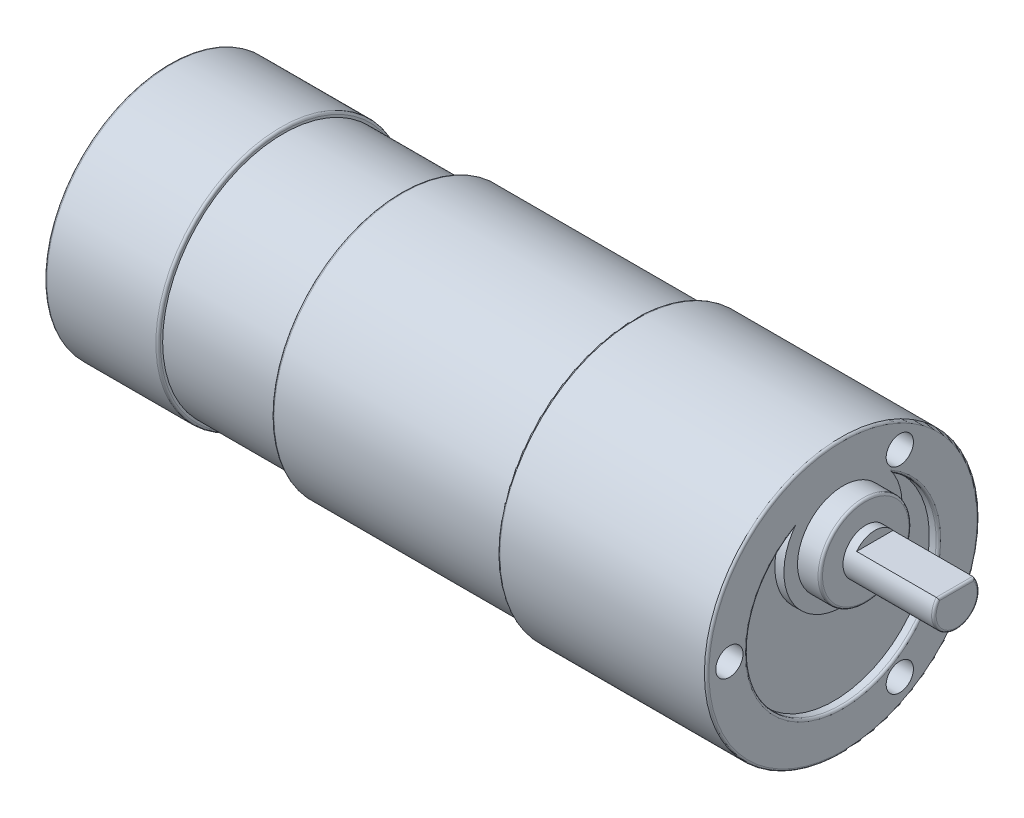
ISO-10303-21;
HEADER;
FILE_DESCRIPTION(('STEP AP214'),'2;1');
FILE_NAME('part.step','',(''),(''),'','','');
FILE_SCHEMA(('AUTOMOTIVE_DESIGN { 1 0 10303 214 1 1 1 1 }'));
ENDSEC;
DATA;
#1=APPLICATION_CONTEXT('core data for automotive mechanical design processes');
#2=APPLICATION_PROTOCOL_DEFINITION('international standard','automotive_design',2000,#1);
#3=PRODUCT_CONTEXT('',#1,'mechanical');
#4=PRODUCT('Part','Part','',(#3));
#5=PRODUCT_RELATED_PRODUCT_CATEGORY('part','',(#4));
#6=PRODUCT_DEFINITION_FORMATION('','',#4);
#7=PRODUCT_DEFINITION_CONTEXT('part definition',#1,'design');
#8=PRODUCT_DEFINITION('design','',#6,#7);
#9=PRODUCT_DEFINITION_SHAPE('','',#8);
#10=(LENGTH_UNIT() NAMED_UNIT(*) SI_UNIT(.MILLI.,.METRE.));
#11=(NAMED_UNIT(*) PLANE_ANGLE_UNIT() SI_UNIT($,.RADIAN.));
#12=(NAMED_UNIT(*) SI_UNIT($,.STERADIAN.) SOLID_ANGLE_UNIT());
#13=UNCERTAINTY_MEASURE_WITH_UNIT(LENGTH_MEASURE(1.E-05),#10,'distance_accuracy_value','');
#14=(GEOMETRIC_REPRESENTATION_CONTEXT(3) GLOBAL_UNCERTAINTY_ASSIGNED_CONTEXT((#13)) GLOBAL_UNIT_ASSIGNED_CONTEXT((#10,
#11,#12)) REPRESENTATION_CONTEXT('',''));
#15=CARTESIAN_POINT('',(0.,0.,0.));
#16=DIRECTION('',(0.,0.,1.));
#17=DIRECTION('',(1.,0.,0.));
#18=AXIS2_PLACEMENT_3D('',#15,#16,#17);
#19=CARTESIAN_POINT('',(74.1,0.,0.));
#20=DIRECTION('',(1.,0.,0.));
#21=DIRECTION('',(0.,0.,-1.));
#22=AXIS2_PLACEMENT_3D('',#19,#20,#21);
#23=PLANE('',#22);
#24=CARTESIAN_POINT('',(74.1,0.,0.));
#25=DIRECTION('',(1.,0.,0.));
#26=DIRECTION('',(0.,0.,-1.));
#27=AXIS2_PLACEMENT_3D('',#24,#25,#26);
#28=CIRCLE('',#27,14.75);
#29=CARTESIAN_POINT('',(74.1,0.,-14.75));
#30=VERTEX_POINT('',#29);
#31=EDGE_CURVE('E186',#30,#30,#28,.T.);
#32=ORIENTED_EDGE('',*,*,#31,.T.);
#33=EDGE_LOOP('',(#32));
#34=FACE_BOUND('',#33,.T.);
#35=CARTESIAN_POINT('',(74.1,0.,12.5));
#36=DIRECTION('',(1.,0.,0.));
#37=DIRECTION('',(0.,0.,-1.));
#38=AXIS2_PLACEMENT_3D('',#35,#36,#37);
#39=CIRCLE('',#38,1.5);
#40=CARTESIAN_POINT('',(74.1,0.,11.));
#41=VERTEX_POINT('',#40);
#42=EDGE_CURVE('E280',#41,#41,#39,.T.);
#43=ORIENTED_EDGE('',*,*,#42,.F.);
#44=EDGE_LOOP('',(#43));
#45=FACE_BOUND('',#44,.T.);
#46=CARTESIAN_POINT('',(74.1,-10.8253175473055,-6.24999999999998));
#47=DIRECTION('',(1.,0.,0.));
#48=DIRECTION('',(0.,0.,-1.));
#49=AXIS2_PLACEMENT_3D('',#46,#47,#48);
#50=CIRCLE('',#49,1.5);
#51=CARTESIAN_POINT('',(74.1,-10.8253175473055,-7.74999999999998));
#52=VERTEX_POINT('',#51);
#53=EDGE_CURVE('E289',#52,#52,#50,.T.);
#54=ORIENTED_EDGE('',*,*,#53,.F.);
#55=EDGE_LOOP('',(#54));
#56=FACE_BOUND('',#55,.T.);
#57=CARTESIAN_POINT('',(74.1,10.8253175473055,-6.24999999999997));
#58=DIRECTION('',(1.,0.,0.));
#59=DIRECTION('',(0.,0.,-1.));
#60=AXIS2_PLACEMENT_3D('',#57,#58,#59);
#61=CIRCLE('',#60,1.5);
#62=CARTESIAN_POINT('',(74.1,10.8253175473055,-7.74999999999997));
#63=VERTEX_POINT('',#62);
#64=EDGE_CURVE('E295',#63,#63,#61,.T.);
#65=ORIENTED_EDGE('',*,*,#64,.F.);
#66=EDGE_LOOP('',(#65));
#67=FACE_BOUND('',#66,.T.);
#68=CARTESIAN_POINT('',(74.1,5.5,0.));
#69=DIRECTION('',(1.,0.,0.));
#70=DIRECTION('',(0.,0.,-1.));
#71=AXIS2_PLACEMENT_3D('',#68,#69,#70);
#72=CIRCLE('',#71,5.);
#73=CARTESIAN_POINT('',(74.1,5.5,-5.));
#74=VERTEX_POINT('',#73);
#75=EDGE_CURVE('E113',#74,#74,#72,.T.);
#76=ORIENTED_EDGE('',*,*,#75,.F.);
#77=EDGE_LOOP('',(#76));
#78=FACE_BOUND('',#77,.T.);
#79=CARTESIAN_POINT('',(74.1,5.5,0.));
#80=DIRECTION('',(1.,0.,0.));
#81=DIRECTION('',(0.,0.,-1.));
#82=AXIS2_PLACEMENT_3D('',#79,#80,#81);
#83=CIRCLE('',#82,6.5);
#84=CARTESIAN_POINT('',(74.1,9.41477272727273,5.18888759695194));
#85=VERTEX_POINT('',#84);
#86=CARTESIAN_POINT('',(74.1,9.41477272727273,-5.18888759695194));
#87=VERTEX_POINT('',#86);
#88=EDGE_CURVE('E105',#85,#87,#83,.T.);
#89=ORIENTED_EDGE('',*,*,#88,.T.);
#90=CARTESIAN_POINT('',(74.1,0.,0.));
#91=DIRECTION('',(1.,0.,0.));
#92=DIRECTION('',(0.,0.,-1.));
#93=AXIS2_PLACEMENT_3D('',#90,#91,#92);
#94=CIRCLE('',#93,10.75);
#95=EDGE_CURVE('E183',#87,#85,#94,.F.);
#96=ORIENTED_EDGE('',*,*,#95,.T.);
#97=EDGE_LOOP('',(#89,#96));
#98=FACE_BOUND('',#97,.T.);
#99=ADVANCED_FACE('F34',(#34,#45,#56,#67,#78,#98),#23,.T.);
#100=CARTESIAN_POINT('',(76.6,0.,0.));
#101=DIRECTION('',(-1.,0.,0.));
#102=DIRECTION('',(0.,0.,1.));
#103=AXIS2_PLACEMENT_3D('',#100,#101,#102);
#104=CYLINDRICAL_SURFACE('',#103,15.);
#105=CARTESIAN_POINT('',(51.35,0.,0.));
#106=DIRECTION('',(-1.,0.,0.));
#107=DIRECTION('',(0.,0.,1.));
#108=AXIS2_PLACEMENT_3D('',#105,#106,#107);
#109=CIRCLE('',#108,15.);
#110=CARTESIAN_POINT('',(51.35,0.,15.));
#111=VERTEX_POINT('',#110);
#112=EDGE_CURVE('E177',#111,#111,#109,.F.);
#113=ORIENTED_EDGE('',*,*,#112,.T.);
#114=EDGE_LOOP('',(#113));
#115=FACE_BOUND('',#114,.T.);
#116=CARTESIAN_POINT('',(73.85,0.,0.));
#117=DIRECTION('',(1.,0.,0.));
#118=DIRECTION('',(0.,0.,-1.));
#119=AXIS2_PLACEMENT_3D('',#116,#117,#118);
#120=CIRCLE('',#119,15.);
#121=CARTESIAN_POINT('',(73.85,0.,-15.));
#122=VERTEX_POINT('',#121);
#123=EDGE_CURVE('E174',#122,#122,#120,.F.);
#124=ORIENTED_EDGE('',*,*,#123,.T.);
#125=EDGE_LOOP('',(#124));
#126=FACE_BOUND('',#125,.T.);
#127=ADVANCED_FACE('F213',(#115,#126),#104,.T.);
#128=CARTESIAN_POINT('',(-4.33,0.,0.));
#129=DIRECTION('',(-1.,0.,0.));
#130=DIRECTION('',(0.,0.,1.));
#131=AXIS2_PLACEMENT_3D('',#128,#129,#130);
#132=CYLINDRICAL_SURFACE('',#131,13.75);
#133=CARTESIAN_POINT('',(12.25,0.,0.));
#134=DIRECTION('',(1.,0.,0.));
#135=DIRECTION('',(0.,0.,-1.));
#136=AXIS2_PLACEMENT_3D('',#133,#134,#135);
#137=CIRCLE('',#136,13.75);
#138=CARTESIAN_POINT('',(12.25,0.,-13.75));
#139=VERTEX_POINT('',#138);
#140=EDGE_CURVE('E159',#139,#139,#137,.F.);
#141=ORIENTED_EDGE('',*,*,#140,.T.);
#142=EDGE_LOOP('',(#141));
#143=FACE_BOUND('',#142,.T.);
#144=CARTESIAN_POINT('',(0.25,0.,0.));
#145=DIRECTION('',(1.,0.,0.));
#146=DIRECTION('',(0.,0.,-1.));
#147=AXIS2_PLACEMENT_3D('',#144,#145,#146);
#148=CIRCLE('',#147,13.75);
#149=CARTESIAN_POINT('',(0.25,0.,-13.75));
#150=VERTEX_POINT('',#149);
#151=EDGE_CURVE('E156',#150,#150,#148,.T.);
#152=ORIENTED_EDGE('',*,*,#151,.T.);
#153=EDGE_LOOP('',(#152));
#154=FACE_BOUND('',#153,.T.);
#155=ADVANCED_FACE('F234',(#143,#154),#132,.T.);
#156=CARTESIAN_POINT('',(12.5,13.75,0.));
#157=DIRECTION('',(1.,0.,0.));
#158=DIRECTION('',(0.,0.,-1.));
#159=AXIS2_PLACEMENT_3D('',#156,#157,#158);
#160=PLANE('',#159);
#161=CARTESIAN_POINT('',(12.5,0.,0.));
#162=DIRECTION('',(1.,0.,0.));
#163=DIRECTION('',(0.,0.,-1.));
#164=AXIS2_PLACEMENT_3D('',#161,#162,#163);
#165=CIRCLE('',#164,13.5);
#166=CARTESIAN_POINT('',(12.5,0.,-13.5));
#167=VERTEX_POINT('',#166);
#168=EDGE_CURVE('E162',#167,#167,#165,.T.);
#169=ORIENTED_EDGE('',*,*,#168,.T.);
#170=EDGE_LOOP('',(#169));
#171=FACE_BOUND('',#170,.T.);
#172=CARTESIAN_POINT('',(12.5,0.,0.));
#173=DIRECTION('',(-1.,0.,0.));
#174=DIRECTION('',(0.,0.,1.));
#175=AXIS2_PLACEMENT_3D('',#172,#173,#174);
#176=CIRCLE('',#175,13.25);
#177=CARTESIAN_POINT('',(12.5,0.,13.25));
#178=VERTEX_POINT('',#177);
#179=EDGE_CURVE('E123',#178,#178,#176,.T.);
#180=ORIENTED_EDGE('',*,*,#179,.T.);
#181=EDGE_LOOP('',(#180));
#182=FACE_BOUND('',#181,.T.);
#183=ADVANCED_FACE('F230',(#171,#182),#160,.T.);
#184=CARTESIAN_POINT('',(-4.33,0.,0.));
#185=DIRECTION('',(-1.,0.,0.));
#186=DIRECTION('',(0.,0.,1.));
#187=AXIS2_PLACEMENT_3D('',#184,#185,#186);
#188=CYLINDRICAL_SURFACE('',#187,13.25);
#189=CARTESIAN_POINT('',(25.5,0.,0.));
#190=DIRECTION('',(-1.,0.,0.));
#191=DIRECTION('',(0.,0.,1.));
#192=AXIS2_PLACEMENT_3D('',#189,#190,#191);
#193=CIRCLE('',#192,13.25);
#194=CARTESIAN_POINT('',(25.5,0.,13.25));
#195=VERTEX_POINT('',#194);
#196=EDGE_CURVE('E120',#195,#195,#193,.T.);
#197=ORIENTED_EDGE('',*,*,#196,.T.);
#198=EDGE_LOOP('',(#197));
#199=FACE_BOUND('',#198,.T.);
#200=ORIENTED_EDGE('',*,*,#179,.F.);
#201=EDGE_LOOP('',(#200));
#202=FACE_BOUND('',#201,.T.);
#203=ADVANCED_FACE('F226',(#199,#202),#188,.T.);
#204=CARTESIAN_POINT('',(25.5,13.25,0.));
#205=DIRECTION('',(-1.,0.,0.));
#206=DIRECTION('',(0.,0.,1.));
#207=AXIS2_PLACEMENT_3D('',#204,#205,#206);
#208=PLANE('',#207);
#209=CARTESIAN_POINT('',(25.5,0.,0.));
#210=DIRECTION('',(-1.,0.,0.));
#211=DIRECTION('',(0.,0.,1.));
#212=AXIS2_PLACEMENT_3D('',#209,#210,#211);
#213=CIRCLE('',#212,14.);
#214=CARTESIAN_POINT('',(25.5,0.,14.));
#215=VERTEX_POINT('',#214);
#216=EDGE_CURVE('E165',#215,#215,#213,.T.);
#217=ORIENTED_EDGE('',*,*,#216,.T.);
#218=EDGE_LOOP('',(#217));
#219=FACE_BOUND('',#218,.T.);
#220=ORIENTED_EDGE('',*,*,#196,.F.);
#221=EDGE_LOOP('',(#220));
#222=FACE_BOUND('',#221,.T.);
#223=ADVANCED_FACE('F222',(#219,#222),#208,.T.);
#224=CARTESIAN_POINT('',(-4.33,0.,0.));
#225=DIRECTION('',(-1.,0.,0.));
#226=DIRECTION('',(0.,0.,1.));
#227=AXIS2_PLACEMENT_3D('',#224,#225,#226);
#228=CYLINDRICAL_SURFACE('',#227,14.25);
#229=CARTESIAN_POINT('',(25.75,0.,0.));
#230=DIRECTION('',(-1.,0.,0.));
#231=DIRECTION('',(0.,0.,1.));
#232=AXIS2_PLACEMENT_3D('',#229,#230,#231);
#233=CIRCLE('',#232,14.25);
#234=CARTESIAN_POINT('',(25.75,0.,14.25));
#235=VERTEX_POINT('',#234);
#236=EDGE_CURVE('E168',#235,#235,#233,.F.);
#237=ORIENTED_EDGE('',*,*,#236,.T.);
#238=EDGE_LOOP('',(#237));
#239=FACE_BOUND('',#238,.T.);
#240=CARTESIAN_POINT('',(51.1,0.,0.));
#241=DIRECTION('',(-1.,0.,0.));
#242=DIRECTION('',(0.,0.,1.));
#243=AXIS2_PLACEMENT_3D('',#240,#241,#242);
#244=CIRCLE('',#243,14.25);
#245=CARTESIAN_POINT('',(51.1,0.,14.25));
#246=VERTEX_POINT('',#245);
#247=EDGE_CURVE('E117',#246,#246,#244,.T.);
#248=ORIENTED_EDGE('',*,*,#247,.T.);
#249=EDGE_LOOP('',(#248));
#250=FACE_BOUND('',#249,.T.);
#251=ADVANCED_FACE('F218',(#239,#250),#228,.T.);
#252=CARTESIAN_POINT('',(51.1,14.25,0.));
#253=DIRECTION('',(-1.,0.,0.));
#254=DIRECTION('',(0.,0.,1.));
#255=AXIS2_PLACEMENT_3D('',#252,#253,#254);
#256=PLANE('',#255);
#257=CARTESIAN_POINT('',(51.1,0.,0.));
#258=DIRECTION('',(-1.,0.,0.));
#259=DIRECTION('',(0.,0.,1.));
#260=AXIS2_PLACEMENT_3D('',#257,#258,#259);
#261=CIRCLE('',#260,14.75);
#262=CARTESIAN_POINT('',(51.1,0.,14.75));
#263=VERTEX_POINT('',#262);
#264=EDGE_CURVE('E171',#263,#263,#261,.T.);
#265=ORIENTED_EDGE('',*,*,#264,.T.);
#266=EDGE_LOOP('',(#265));
#267=FACE_BOUND('',#266,.T.);
#268=ORIENTED_EDGE('',*,*,#247,.F.);
#269=EDGE_LOOP('',(#268));
#270=FACE_BOUND('',#269,.T.);
#271=ADVANCED_FACE('F215',(#267,#270),#256,.T.);
#272=CARTESIAN_POINT('',(0.,0.,0.));
#273=DIRECTION('',(1.,0.,0.));
#274=DIRECTION('',(0.,0.,-1.));
#275=AXIS2_PLACEMENT_3D('',#272,#273,#274);
#276=PLANE('',#275);
#277=CARTESIAN_POINT('',(0.,0.,0.));
#278=DIRECTION('',(1.,0.,0.));
#279=DIRECTION('',(0.,0.,-1.));
#280=AXIS2_PLACEMENT_3D('',#277,#278,#279);
#281=CIRCLE('',#280,13.5);
#282=CARTESIAN_POINT('',(0.,0.,-13.5));
#283=VERTEX_POINT('',#282);
#284=EDGE_CURVE('E180',#283,#283,#281,.F.);
#285=ORIENTED_EDGE('',*,*,#284,.T.);
#286=EDGE_LOOP('',(#285));
#287=FACE_BOUND('',#286,.T.);
#288=ADVANCED_FACE('F209',(#287),#276,.F.);
#289=CARTESIAN_POINT('',(74.1,5.5,0.));
#290=DIRECTION('',(1.,0.,0.));
#291=DIRECTION('',(0.,0.,-1.));
#292=AXIS2_PLACEMENT_3D('',#289,#290,#291);
#293=CYLINDRICAL_SURFACE('',#292,5.);
#294=CARTESIAN_POINT('',(76.35,5.5,0.));
#295=DIRECTION('',(1.,0.,0.));
#296=DIRECTION('',(0.,0.,-1.));
#297=AXIS2_PLACEMENT_3D('',#294,#295,#296);
#298=CIRCLE('',#297,5.);
#299=CARTESIAN_POINT('',(76.35,5.5,-5.));
#300=VERTEX_POINT('',#299);
#301=EDGE_CURVE('E153',#300,#300,#298,.F.);
#302=ORIENTED_EDGE('',*,*,#301,.T.);
#303=EDGE_LOOP('',(#302));
#304=FACE_BOUND('',#303,.T.);
#305=ORIENTED_EDGE('',*,*,#75,.T.);
#306=EDGE_LOOP('',(#305));
#307=FACE_BOUND('',#306,.T.);
#308=ADVANCED_FACE('F204',(#304,#307),#293,.T.);
#309=CARTESIAN_POINT('',(77.6,5.5,0.));
#310=DIRECTION('',(1.,0.,0.));
#311=DIRECTION('',(0.,0.,-1.));
#312=AXIS2_PLACEMENT_3D('',#309,#310,#311);
#313=PLANE('',#312);
#314=CARTESIAN_POINT('',(77.6,5.5,0.));
#315=DIRECTION('',(1.,0.,0.));
#316=DIRECTION('',(0.,0.,-1.));
#317=AXIS2_PLACEMENT_3D('',#314,#315,#316);
#318=CIRCLE('',#317,2.5);
#319=CARTESIAN_POINT('',(77.6,7.,-2.));
#320=VERTEX_POINT('',#319);
#321=CARTESIAN_POINT('',(77.6,7.,2.));
#322=VERTEX_POINT('',#321);
#323=EDGE_CURVE('E126',#320,#322,#318,.T.);
#324=ORIENTED_EDGE('',*,*,#323,.T.);
#325=DIRECTION('',(0.,0.,-1.));
#326=VECTOR('',#325,1.);
#327=CARTESIAN_POINT('',(77.6,7.,2.));
#328=LINE('',#327,#326);
#329=EDGE_CURVE('E128',#322,#320,#328,.T.);
#330=ORIENTED_EDGE('',*,*,#329,.T.);
#331=EDGE_LOOP('',(#324,#330));
#332=FACE_BOUND('',#331,.T.);
#333=ADVANCED_FACE('F208',(#332),#313,.T.);
#334=CARTESIAN_POINT('',(77.6,7.,2.));
#335=DIRECTION('',(0.,-1.,0.));
#336=DIRECTION('',(0.,0.,-1.));
#337=AXIS2_PLACEMENT_3D('',#334,#335,#336);
#338=PLANE('',#337);
#339=DIRECTION('',(1.,0.,0.));
#340=VECTOR('',#339,1.);
#341=CARTESIAN_POINT('',(77.6,7.,2.));
#342=LINE('',#341,#340);
#343=CARTESIAN_POINT('',(86.35,7.,2.));
#344=VERTEX_POINT('',#343);
#345=EDGE_CURVE('E131',#322,#344,#342,.T.);
#346=ORIENTED_EDGE('',*,*,#345,.T.);
#347=DIRECTION('',(0.,0.,-1.));
#348=VECTOR('',#347,1.);
#349=CARTESIAN_POINT('',(86.35,7.,-2.));
#350=LINE('',#349,#348);
#351=CARTESIAN_POINT('',(86.35,7.,-2.));
#352=VERTEX_POINT('',#351);
#353=EDGE_CURVE('E140',#344,#352,#350,.T.);
#354=ORIENTED_EDGE('',*,*,#353,.T.);
#355=DIRECTION('',(1.,0.,0.));
#356=VECTOR('',#355,1.);
#357=CARTESIAN_POINT('',(77.6,7.,-2.));
#358=LINE('',#357,#356);
#359=EDGE_CURVE('E132',#320,#352,#358,.T.);
#360=ORIENTED_EDGE('',*,*,#359,.F.);
#361=ORIENTED_EDGE('',*,*,#329,.F.);
#362=EDGE_LOOP('',(#346,#354,#360,#361));
#363=FACE_BOUND('',#362,.T.);
#364=ADVANCED_FACE('F241',(#363),#338,.F.);
#365=CARTESIAN_POINT('',(86.6,5.5,0.));
#366=DIRECTION('',(1.,0.,0.));
#367=DIRECTION('',(0.,0.,-1.));
#368=AXIS2_PLACEMENT_3D('',#365,#366,#367);
#369=PLANE('',#368);
#370=CARTESIAN_POINT('',(86.6,5.5,0.));
#371=DIRECTION('',(1.,0.,0.));
#372=DIRECTION('',(0.,0.,-1.));
#373=AXIS2_PLACEMENT_3D('',#370,#371,#372);
#374=CIRCLE('',#373,2.25);
#375=CARTESIAN_POINT('',(86.6,6.74999999999992,1.87082869338702));
#376=VERTEX_POINT('',#375);
#377=CARTESIAN_POINT('',(86.6,6.74999999999992,-1.87082869338702));
#378=VERTEX_POINT('',#377);
#379=EDGE_CURVE('E143',#376,#378,#374,.T.);
#380=ORIENTED_EDGE('',*,*,#379,.T.);
#381=DIRECTION('',(0.,0.,-1.));
#382=VECTOR('',#381,1.);
#383=CARTESIAN_POINT('',(86.6,6.75,2.));
#384=LINE('',#383,#382);
#385=EDGE_CURVE('E145',#378,#376,#384,.F.);
#386=ORIENTED_EDGE('',*,*,#385,.T.);
#387=EDGE_LOOP('',(#380,#386));
#388=FACE_BOUND('',#387,.T.);
#389=ADVANCED_FACE('F245',(#388),#369,.T.);
#390=CARTESIAN_POINT('',(86.6,5.5,0.));
#391=DIRECTION('',(-1.,0.,0.));
#392=DIRECTION('',(0.,0.,1.));
#393=AXIS2_PLACEMENT_3D('',#390,#391,#392);
#394=CYLINDRICAL_SURFACE('',#393,2.5);
#395=ORIENTED_EDGE('',*,*,#359,.T.);
#396=CARTESIAN_POINT('',(86.35,5.5,0.));
#397=DIRECTION('',(1.,0.,0.));
#398=DIRECTION('',(0.,0.,-1.));
#399=AXIS2_PLACEMENT_3D('',#396,#397,#398);
#400=CIRCLE('',#399,2.5);
#401=EDGE_CURVE('E148',#352,#344,#400,.F.);
#402=ORIENTED_EDGE('',*,*,#401,.T.);
#403=ORIENTED_EDGE('',*,*,#345,.F.);
#404=ORIENTED_EDGE('',*,*,#323,.F.);
#405=EDGE_LOOP('',(#395,#402,#403,#404));
#406=FACE_BOUND('',#405,.T.);
#407=CARTESIAN_POINT('',(76.6,5.5,0.));
#408=DIRECTION('',(1.,0.,0.));
#409=DIRECTION('',(0.,0.,-1.));
#410=AXIS2_PLACEMENT_3D('',#407,#408,#409);
#411=CIRCLE('',#410,2.5);
#412=CARTESIAN_POINT('',(76.6,5.5,-2.5));
#413=VERTEX_POINT('',#412);
#414=EDGE_CURVE('E135',#413,#413,#411,.T.);
#415=ORIENTED_EDGE('',*,*,#414,.T.);
#416=EDGE_LOOP('',(#415));
#417=FACE_BOUND('',#416,.T.);
#418=ADVANCED_FACE('F249',(#406,#417),#394,.T.);
#419=CARTESIAN_POINT('',(76.6,0.,0.));
#420=DIRECTION('',(1.,0.,0.));
#421=DIRECTION('',(0.,0.,-1.));
#422=AXIS2_PLACEMENT_3D('',#419,#420,#421);
#423=PLANE('',#422);
#424=CARTESIAN_POINT('',(76.6,5.5,0.));
#425=DIRECTION('',(1.,0.,0.));
#426=DIRECTION('',(0.,0.,-1.));
#427=AXIS2_PLACEMENT_3D('',#424,#425,#426);
#428=CIRCLE('',#427,4.75);
#429=CARTESIAN_POINT('',(76.6,5.5,-4.75));
#430=VERTEX_POINT('',#429);
#431=EDGE_CURVE('E150',#430,#430,#428,.T.);
#432=ORIENTED_EDGE('',*,*,#431,.T.);
#433=EDGE_LOOP('',(#432));
#434=FACE_BOUND('',#433,.T.);
#435=ORIENTED_EDGE('',*,*,#414,.F.);
#436=EDGE_LOOP('',(#435));
#437=FACE_BOUND('',#436,.T.);
#438=ADVANCED_FACE('F202',(#434,#437),#423,.T.);
#439=CARTESIAN_POINT('',(73.1,5.5,0.));
#440=DIRECTION('',(1.,0.,0.));
#441=DIRECTION('',(0.,0.,-1.));
#442=AXIS2_PLACEMENT_3D('',#439,#440,#441);
#443=CYLINDRICAL_SURFACE('',#442,6.5);
#444=ORIENTED_EDGE('',*,*,#88,.F.);
#445=CARTESIAN_POINT('',(74.1,9.41477272727273,5.18888759695194));
#446=CARTESIAN_POINT('',(74.0999831649846,9.39188239122904,5.20615884082959));
#447=CARTESIAN_POINT('',(74.0991753234182,9.36886658255452,5.22328398875272));
#448=CARTESIAN_POINT('',(74.0957931354124,9.3226129209461,5.25722854772138));
#449=CARTESIAN_POINT('',(74.0932123987342,9.29937456562936,5.27404662610108));
#450=CARTESIAN_POINT('',(74.0861164066224,9.25299622371637,5.3071487445332));
#451=CARTESIAN_POINT('',(74.0816115410013,9.2298563734107,5.3234351542232));
#452=CARTESIAN_POINT('',(74.0703431126138,9.18376488104019,5.35543275883427));
#453=CARTESIAN_POINT('',(74.0635833442933,9.16081298872184,5.37114487120059));
#454=CARTESIAN_POINT('',(74.0505738368938,9.12464922044669,5.39557066729247));
#455=CARTESIAN_POINT('',(74.0452363549753,9.11127527741722,5.40452991113922));
#456=CARTESIAN_POINT('',(74.0333522593504,9.08475501451608,5.42215693384593));
#457=CARTESIAN_POINT('',(74.0267996367027,9.07161019745475,5.43082299943601));
#458=CARTESIAN_POINT('',(74.0100937271802,9.04198319364183,5.4502068165354));
#459=CARTESIAN_POINT('',(73.9994491725242,9.02567126336535,5.46076813371098));
#460=CARTESIAN_POINT('',(73.9749067539139,8.99480513941149,5.48057142003858));
#461=CARTESIAN_POINT('',(73.9610379237557,8.9802369205262,5.4898240431316));
#462=CARTESIAN_POINT('',(73.9390596873975,8.96299069281043,5.50070244888107));
#463=CARTESIAN_POINT('',(73.9328544347275,8.95861949916991,5.50345109614572));
#464=CARTESIAN_POINT('',(73.919790137191,8.95061304835876,5.50847451220193));
#465=CARTESIAN_POINT('',(73.9129306928377,8.94697824515758,5.51074898870195));
#466=CARTESIAN_POINT('',(73.8984844869997,8.94066519711013,5.51469285374608));
#467=CARTESIAN_POINT('',(73.8908887089306,8.9380014115633,5.51635310089658));
#468=CARTESIAN_POINT('',(73.875230242602,8.93401862802945,5.51883337619474));
#469=CARTESIAN_POINT('',(73.8671696716696,8.93269397335876,5.5196569386938));
#470=CARTESIAN_POINT('',(73.8575477575341,8.93202684836659,5.52007171065));
#471=CARTESIAN_POINT('',(73.8560393566279,8.93194865450147,5.52012032670253));
#472=CARTESIAN_POINT('',(73.8530208395366,8.93184443409094,5.52018512365069));
#473=CARTESIAN_POINT('',(73.8515107246499,8.93181838046335,5.52020132138473));
#474=CARTESIAN_POINT('',(73.85,8.93181818181818,5.52020144260535));
#475=B_SPLINE_CURVE_WITH_KNOTS('',3,(#445,#446,#447,#448,#449,#450,#451,#452,#453,#454,#455,
#456,#457,#458,#459,#460,#461,#462,#463,#464,#465,#466,#467,#468,#469,#470,#471,#472,#473,#474),
.UNSPECIFIED.,.F.,.F.,(4,2,2,2,2,2,2,2,2,2,2,2,2,2,4),(0.,0.086033021068687,0.172377778646507,
0.258262076114619,0.34400257444526,0.394845140897501,0.445946176578029,0.512246641303248,
0.577971751342751,0.60213310887671,0.626309316363986,0.650832092329457,0.675250842150749,
0.679783842547829,0.684314487845205),.UNSPECIFIED.);
#476=CARTESIAN_POINT('',(73.85,8.93181818181818,5.52020144260535));
#477=VERTEX_POINT('',#476);
#478=EDGE_CURVE('E11',#85,#477,#475,.T.);
#479=ORIENTED_EDGE('',*,*,#478,.T.);
#480=DIRECTION('',(1.,0.,0.));
#481=VECTOR('',#480,1.);
#482=CARTESIAN_POINT('',(73.1,8.93181818181818,5.52020144260535));
#483=LINE('',#482,#481);
#484=CARTESIAN_POINT('',(73.1,8.93181818181818,5.52020144260535));
#485=VERTEX_POINT('',#484);
#486=EDGE_CURVE('E91',#485,#477,#483,.T.);
#487=ORIENTED_EDGE('',*,*,#486,.F.);
#488=CARTESIAN_POINT('',(73.1,5.5,0.));
#489=DIRECTION('',(1.,0.,0.));
#490=DIRECTION('',(0.,0.,-1.));
#491=AXIS2_PLACEMENT_3D('',#488,#489,#490);
#492=CIRCLE('',#491,6.5);
#493=CARTESIAN_POINT('',(73.1,8.93181818181818,-5.52020144260535));
#494=VERTEX_POINT('',#493);
#495=EDGE_CURVE('E95',#485,#494,#492,.T.);
#496=ORIENTED_EDGE('',*,*,#495,.T.);
#497=DIRECTION('',(1.,0.,0.));
#498=VECTOR('',#497,1.);
#499=CARTESIAN_POINT('',(73.1,8.93181818181818,-5.52020144260535));
#500=LINE('',#499,#498);
#501=CARTESIAN_POINT('',(73.85,8.93181818181818,-5.52020144260535));
#502=VERTEX_POINT('',#501);
#503=EDGE_CURVE('E99',#494,#502,#500,.T.);
#504=ORIENTED_EDGE('',*,*,#503,.T.);
#505=CARTESIAN_POINT('',(73.85,8.93181818181818,-5.52020144260535));
#506=CARTESIAN_POINT('',(73.8568371419132,8.93180281094858,-5.52021065025864));
#507=CARTESIAN_POINT('',(73.8636509768345,8.93235286954474,-5.51986905081773));
#508=CARTESIAN_POINT('',(73.876989340396,8.93444190697464,-5.51856967414837));
#509=CARTESIAN_POINT('',(73.8835162568305,8.93596972410108,-5.51761885142953));
#510=CARTESIAN_POINT('',(73.8977122879727,8.94034426729592,-5.51489246680858));
#511=CARTESIAN_POINT('',(73.9052822443313,8.94341873928312,-5.51297423179716));
#512=CARTESIAN_POINT('',(73.9197603296231,8.95056087529103,-5.50850684291174));
#513=CARTESIAN_POINT('',(73.9266652003571,8.95463311359151,-5.50595478249582));
#514=CARTESIAN_POINT('',(73.9436441527478,8.96608952093307,-5.4987536130998));
#515=CARTESIAN_POINT('',(73.9531990477944,8.97401453429378,-5.49375295379665));
#516=CARTESIAN_POINT('',(73.9708239918423,8.99092131612563,-5.48302565409446));
#517=CARTESIAN_POINT('',(73.9788911113355,8.99990511360151,-5.47729761810294));
#518=CARTESIAN_POINT('',(74.0009226539621,9.02736326340329,-5.4596857108105));
#519=CARTESIAN_POINT('',(74.0132029619165,9.04674096011591,-5.44712634608222));
#520=CARTESIAN_POINT('',(74.0346159086907,9.08660356892157,-5.42096437681789));
#521=CARTESIAN_POINT('',(74.043726376092,9.10709516473281,-5.40735520656361));
#522=CARTESIAN_POINT('',(74.0607250616321,9.15178411402678,-5.37729528535604));
#523=CARTESIAN_POINT('',(74.0682011480643,9.17606104847757,-5.36073235371579));
#524=CARTESIAN_POINT('',(74.0805871535669,9.22485399697535,-5.32694543446326));
#525=CARTESIAN_POINT('',(74.0854919304833,9.24937039097393,-5.30972019559369));
#526=CARTESIAN_POINT('',(74.0929885834177,9.29751029419979,-5.27539166677475));
#527=CARTESIAN_POINT('',(74.095656243952,9.32113466528149,-5.25830567614696));
#528=CARTESIAN_POINT('',(74.0991490837716,9.36813965922631,-5.22382484869674));
#529=CARTESIAN_POINT('',(74.099982149429,9.39152089368149,-5.2064316590972));
#530=CARTESIAN_POINT('',(74.1,9.41477272727273,-5.18888759695194));
#531=B_SPLINE_CURVE_WITH_KNOTS('',3,(#505,#506,#507,#508,#509,#510,#511,#512,#513,#514,#515,
#516,#517,#518,#519,#520,#521,#522,#523,#524,#525,#526,#527,#528,#529,#530),.UNSPECIFIED.,.F.,
.F.,(4,2,2,2,2,2,2,2,2,2,2,2,4),(0.,0.0204431686751535,0.0406570308188243,0.0656950451517033,
0.0908500681074269,0.130772663874315,0.170773049049668,0.248799144665643,0.327360511106286,
0.418172588881486,0.509165588209976,0.596934921785879,0.684326218799791),.UNSPECIFIED.);
#532=EDGE_CURVE('E49',#502,#87,#531,.T.);
#533=ORIENTED_EDGE('',*,*,#532,.T.);
#534=EDGE_LOOP('',(#444,#479,#487,#496,#504,#533));
#535=FACE_BOUND('',#534,.T.);
#536=ADVANCED_FACE('F93',(#535),#443,.T.);
#537=CARTESIAN_POINT('',(73.1,0.,0.));
#538=DIRECTION('',(1.,0.,0.));
#539=DIRECTION('',(0.,0.,-1.));
#540=AXIS2_PLACEMENT_3D('',#537,#538,#539);
#541=CYLINDRICAL_SURFACE('',#540,10.5);
#542=ORIENTED_EDGE('',*,*,#486,.T.);
#543=CARTESIAN_POINT('',(73.85,0.,0.));
#544=DIRECTION('',(1.,0.,0.));
#545=DIRECTION('',(0.,0.,-1.));
#546=AXIS2_PLACEMENT_3D('',#543,#544,#545);
#547=CIRCLE('',#546,10.5);
#548=EDGE_CURVE('E189',#477,#502,#547,.T.);
#549=ORIENTED_EDGE('',*,*,#548,.T.);
#550=ORIENTED_EDGE('',*,*,#503,.F.);
#551=CARTESIAN_POINT('',(73.1,0.,0.));
#552=DIRECTION('',(1.,0.,0.));
#553=DIRECTION('',(0.,0.,-1.));
#554=AXIS2_PLACEMENT_3D('',#551,#552,#553);
#555=CIRCLE('',#554,10.5);
#556=EDGE_CURVE('E100',#485,#494,#555,.T.);
#557=ORIENTED_EDGE('',*,*,#556,.F.);
#558=EDGE_LOOP('',(#542,#549,#550,#557));
#559=FACE_BOUND('',#558,.T.);
#560=ADVANCED_FACE('F107',(#559),#541,.F.);
#561=CARTESIAN_POINT('',(73.1,0.,-33.1414213562373));
#562=DIRECTION('',(1.,0.,0.));
#563=DIRECTION('',(0.,0.,-1.));
#564=AXIS2_PLACEMENT_3D('',#561,#562,#563);
#565=PLANE('',#564);
#566=ORIENTED_EDGE('',*,*,#495,.F.);
#567=ORIENTED_EDGE('',*,*,#556,.T.);
#568=EDGE_LOOP('',(#566,#567));
#569=FACE_BOUND('',#568,.T.);
#570=ADVANCED_FACE('F104',(#569),#565,.T.);
#571=CARTESIAN_POINT('',(70.1,10.8253175473055,-6.24999999999997));
#572=DIRECTION('',(1.,0.,0.));
#573=DIRECTION('',(0.,0.,-1.));
#574=AXIS2_PLACEMENT_3D('',#571,#572,#573);
#575=CYLINDRICAL_SURFACE('',#574,1.5);
#576=CARTESIAN_POINT('',(70.1,10.8253175473055,-6.24999999999997));
#577=DIRECTION('',(1.,0.,0.));
#578=DIRECTION('',(0.,0.,-1.));
#579=AXIS2_PLACEMENT_3D('',#576,#577,#578);
#580=CIRCLE('',#579,1.5);
#581=CARTESIAN_POINT('',(70.1,10.8253175473055,-7.74999999999997));
#582=VERTEX_POINT('',#581);
#583=EDGE_CURVE('E112',#582,#582,#580,.T.);
#584=ORIENTED_EDGE('',*,*,#583,.F.);
#585=EDGE_LOOP('',(#584));
#586=FACE_BOUND('',#585,.T.);
#587=ORIENTED_EDGE('',*,*,#64,.T.);
#588=EDGE_LOOP('',(#587));
#589=FACE_BOUND('',#588,.T.);
#590=ADVANCED_FACE('F302',(#586,#589),#575,.F.);
#591=CARTESIAN_POINT('',(70.1,10.8253175473055,-6.24999999999997));
#592=DIRECTION('',(1.,0.,0.));
#593=DIRECTION('',(0.,0.,-1.));
#594=AXIS2_PLACEMENT_3D('',#591,#592,#593);
#595=PLANE('',#594);
#596=ORIENTED_EDGE('',*,*,#583,.T.);
#597=EDGE_LOOP('',(#596));
#598=FACE_BOUND('',#597,.T.);
#599=ADVANCED_FACE('F385',(#598),#595,.T.);
#600=CARTESIAN_POINT('',(70.1,-10.8253175473055,-6.24999999999998));
#601=DIRECTION('',(1.,0.,0.));
#602=DIRECTION('',(0.,0.,-1.));
#603=AXIS2_PLACEMENT_3D('',#600,#601,#602);
#604=CYLINDRICAL_SURFACE('',#603,1.5);
#605=CARTESIAN_POINT('',(70.1,-10.8253175473055,-6.24999999999998));
#606=DIRECTION('',(1.,0.,0.));
#607=DIRECTION('',(0.,0.,-1.));
#608=AXIS2_PLACEMENT_3D('',#605,#606,#607);
#609=CIRCLE('',#608,1.5);
#610=CARTESIAN_POINT('',(70.1,-10.8253175473055,-7.74999999999998));
#611=VERTEX_POINT('',#610);
#612=EDGE_CURVE('E292',#611,#611,#609,.T.);
#613=ORIENTED_EDGE('',*,*,#612,.F.);
#614=EDGE_LOOP('',(#613));
#615=FACE_BOUND('',#614,.T.);
#616=ORIENTED_EDGE('',*,*,#53,.T.);
#617=EDGE_LOOP('',(#616));
#618=FACE_BOUND('',#617,.T.);
#619=ADVANCED_FACE('F377',(#615,#618),#604,.F.);
#620=CARTESIAN_POINT('',(70.1,-10.8253175473055,-6.24999999999998));
#621=DIRECTION('',(1.,0.,0.));
#622=DIRECTION('',(0.,0.,-1.));
#623=AXIS2_PLACEMENT_3D('',#620,#621,#622);
#624=PLANE('',#623);
#625=ORIENTED_EDGE('',*,*,#612,.T.);
#626=EDGE_LOOP('',(#625));
#627=FACE_BOUND('',#626,.T.);
#628=ADVANCED_FACE('F368',(#627),#624,.T.);
#629=CARTESIAN_POINT('',(70.1,0.,12.5));
#630=DIRECTION('',(1.,0.,0.));
#631=DIRECTION('',(0.,0.,-1.));
#632=AXIS2_PLACEMENT_3D('',#629,#630,#631);
#633=CYLINDRICAL_SURFACE('',#632,1.5);
#634=CARTESIAN_POINT('',(70.1,0.,12.5));
#635=DIRECTION('',(1.,0.,0.));
#636=DIRECTION('',(0.,0.,-1.));
#637=AXIS2_PLACEMENT_3D('',#634,#635,#636);
#638=CIRCLE('',#637,1.5);
#639=CARTESIAN_POINT('',(70.1,0.,11.));
#640=VERTEX_POINT('',#639);
#641=EDGE_CURVE('E284',#640,#640,#638,.T.);
#642=ORIENTED_EDGE('',*,*,#641,.F.);
#643=EDGE_LOOP('',(#642));
#644=FACE_BOUND('',#643,.T.);
#645=ORIENTED_EDGE('',*,*,#42,.T.);
#646=EDGE_LOOP('',(#645));
#647=FACE_BOUND('',#646,.T.);
#648=ADVANCED_FACE('F358',(#644,#647),#633,.F.);
#649=CARTESIAN_POINT('',(70.1,0.,12.5));
#650=DIRECTION('',(1.,0.,0.));
#651=DIRECTION('',(0.,0.,-1.));
#652=AXIS2_PLACEMENT_3D('',#649,#650,#651);
#653=PLANE('',#652);
#654=ORIENTED_EDGE('',*,*,#641,.T.);
#655=EDGE_LOOP('',(#654));
#656=FACE_BOUND('',#655,.T.);
#657=ADVANCED_FACE('F266',(#656),#653,.T.);
#658=CARTESIAN_POINT('',(86.35,5.5,0.));
#659=DIRECTION('',(1.,0.,0.));
#660=DIRECTION('',(0.,0.,-1.));
#661=AXIS2_PLACEMENT_3D('',#658,#659,#660);
#662=TOROIDAL_SURFACE('',#661,2.25,0.25);
#663=CARTESIAN_POINT('',(86.35,7.,-2.));
#664=CARTESIAN_POINT('',(86.3629858188478,7.00001588317613,-2.00000720642817));
#665=CARTESIAN_POINT('',(86.3759599401248,6.99898932937452,-1.99949466157232));
#666=CARTESIAN_POINT('',(86.4014788960029,6.99497751569784,-1.99748762295127));
#667=CARTESIAN_POINT('',(86.4140250699933,6.99199909959672,-1.99599656011765));
#668=CARTESIAN_POINT('',(86.4383715392395,6.98421017461929,-1.99209033676991));
#669=CARTESIAN_POINT('',(86.4501722172479,6.97940061494954,-1.98967565502744));
#670=CARTESIAN_POINT('',(86.4727554795926,6.9681518869982,-1.98401406728345));
#671=CARTESIAN_POINT('',(86.4835374792155,6.96171179051115,-1.98076668724349));
#672=CARTESIAN_POINT('',(86.5042706530644,6.94714849754343,-1.97340088241493));
#673=CARTESIAN_POINT('',(86.5141706579347,6.93896781095042,-1.96925256549488));
#674=CARTESIAN_POINT('',(86.5324600474703,6.92137529520164,-1.96029860793866));
#675=CARTESIAN_POINT('',(86.5408489885841,6.9119631059508,-1.95549277502399));
#676=CARTESIAN_POINT('',(86.5567699291951,6.89118824542553,-1.9448412686013));
#677=CARTESIAN_POINT('',(86.5641326171242,6.87972465525421,-1.93893967786406));
#678=CARTESIAN_POINT('',(86.5768333989485,6.85596364076082,-1.92664607128975));
#679=CARTESIAN_POINT('',(86.5821700221554,6.84366561834105,-1.92025370323619));
#680=CARTESIAN_POINT('',(86.5908250259605,6.81843219632301,-1.90706797943978));
#681=CARTESIAN_POINT('',(86.5941243102735,6.80549195886683,-1.90027146539203));
#682=CARTESIAN_POINT('',(86.5986199020839,6.77937937040617,-1.8864798226521));
#683=CARTESIAN_POINT('',(86.5998202657655,6.76620751689498,-1.87948510364914));
#684=CARTESIAN_POINT('',(86.5999937753352,6.752039005063,-1.87191835122826));
#685=CARTESIAN_POINT('',(86.6000000119549,6.7510193978127,-1.87137358658556));
#686=CARTESIAN_POINT('',(86.6,6.75,-1.87082869338697));
#687=B_SPLINE_CURVE_WITH_KNOTS('',3,(#663,#664,#665,#666,#667,#668,#669,#670,#671,#672,#673,
#674,#675,#676,#677,#678,#679,#680,#681,#682,#683,#684,#685,#686),.UNSPECIFIED.,.F.,.F.,(4,2,2,
2,2,2,2,2,2,2,2,4),(0.,0.0388885936725162,0.0776415574225014,0.116374460159236,
0.155129461903457,0.195450303725417,0.235782961940748,0.280144556295894,0.324538290740358,
0.36934205751793,0.414059144501249,0.417527156387698),.UNSPECIFIED.);
#688=EDGE_CURVE('E271',#378,#352,#687,.F.);
#689=ORIENTED_EDGE('',*,*,#688,.F.);
#690=ORIENTED_EDGE('',*,*,#379,.F.);
#691=CARTESIAN_POINT('',(86.35,7.,2.));
#692=CARTESIAN_POINT('',(86.3629858188478,7.00001588317613,2.00000720642817));
#693=CARTESIAN_POINT('',(86.3759599401248,6.99898932937452,1.99949466157232));
#694=CARTESIAN_POINT('',(86.4014788960029,6.99497751569784,1.99748762295127));
#695=CARTESIAN_POINT('',(86.4140250699933,6.99199909959672,1.99599656011765));
#696=CARTESIAN_POINT('',(86.4383715392395,6.98421017461929,1.99209033676991));
#697=CARTESIAN_POINT('',(86.4501722172479,6.97940061494954,1.98967565502744));
#698=CARTESIAN_POINT('',(86.4727554795926,6.9681518869982,1.98401406728345));
#699=CARTESIAN_POINT('',(86.4835374792155,6.96171179051115,1.98076668724349));
#700=CARTESIAN_POINT('',(86.5042706530644,6.94714849754343,1.97340088241493));
#701=CARTESIAN_POINT('',(86.5141706579347,6.93896781095042,1.96925256549488));
#702=CARTESIAN_POINT('',(86.5324600474703,6.92137529520164,1.96029860793866));
#703=CARTESIAN_POINT('',(86.5408489885841,6.9119631059508,1.95549277502399));
#704=CARTESIAN_POINT('',(86.5567699291951,6.89118824542553,1.9448412686013));
#705=CARTESIAN_POINT('',(86.5641326171242,6.87972465525421,1.93893967786406));
#706=CARTESIAN_POINT('',(86.5768333989485,6.85596364076082,1.92664607128975));
#707=CARTESIAN_POINT('',(86.5821700221554,6.84366561834105,1.92025370323619));
#708=CARTESIAN_POINT('',(86.5908250259605,6.81843219632301,1.90706797943978));
#709=CARTESIAN_POINT('',(86.5941243102735,6.80549195886683,1.90027146539203));
#710=CARTESIAN_POINT('',(86.5986199020839,6.77937937040617,1.8864798226521));
#711=CARTESIAN_POINT('',(86.5998202657655,6.76620751689498,1.87948510364914));
#712=CARTESIAN_POINT('',(86.5999937753352,6.752039005063,1.87191835122826));
#713=CARTESIAN_POINT('',(86.6000000119549,6.7510193978127,1.87137358658556));
#714=CARTESIAN_POINT('',(86.6,6.75,1.87082869338697));
#715=B_SPLINE_CURVE_WITH_KNOTS('',3,(#691,#692,#693,#694,#695,#696,#697,#698,#699,#700,#701,
#702,#703,#704,#705,#706,#707,#708,#709,#710,#711,#712,#713,#714),.UNSPECIFIED.,.F.,.F.,(4,2,2,
2,2,2,2,2,2,2,2,4),(0.,0.0388885936725162,0.0776415574225014,0.116374460159236,
0.155129461903457,0.195450303725417,0.235782961940748,0.280144556295894,0.324538290740358,
0.36934205751793,0.414059144501249,0.417527156387698),.UNSPECIFIED.);
#716=EDGE_CURVE('E39',#344,#376,#715,.T.);
#717=ORIENTED_EDGE('',*,*,#716,.F.);
#718=ORIENTED_EDGE('',*,*,#401,.F.);
#719=EDGE_LOOP('',(#689,#690,#717,#718));
#720=FACE_BOUND('',#719,.T.);
#721=ADVANCED_FACE('F262',(#720),#662,.T.);
#722=CARTESIAN_POINT('',(86.35,6.75,2.));
#723=DIRECTION('',(0.,0.,1.));
#724=DIRECTION('',(1.,0.,0.));
#725=AXIS2_PLACEMENT_3D('',#722,#723,#724);
#726=CYLINDRICAL_SURFACE('',#725,0.25);
#727=ORIENTED_EDGE('',*,*,#716,.T.);
#728=ORIENTED_EDGE('',*,*,#385,.F.);
#729=ORIENTED_EDGE('',*,*,#688,.T.);
#730=ORIENTED_EDGE('',*,*,#353,.F.);
#731=EDGE_LOOP('',(#727,#728,#729,#730));
#732=FACE_BOUND('',#731,.T.);
#733=ADVANCED_FACE('F265',(#732),#726,.T.);
#734=CARTESIAN_POINT('',(76.35,5.5,0.));
#735=DIRECTION('',(1.,0.,0.));
#736=DIRECTION('',(0.,0.,-1.));
#737=AXIS2_PLACEMENT_3D('',#734,#735,#736);
#738=TOROIDAL_SURFACE('',#737,4.75,0.25);
#739=ORIENTED_EDGE('',*,*,#301,.F.);
#740=EDGE_LOOP('',(#739));
#741=FACE_BOUND('',#740,.T.);
#742=ORIENTED_EDGE('',*,*,#431,.F.);
#743=EDGE_LOOP('',(#742));
#744=FACE_BOUND('',#743,.T.);
#745=ADVANCED_FACE('F332',(#741,#744),#738,.T.);
#746=CARTESIAN_POINT('',(12.25,0.,0.));
#747=DIRECTION('',(1.,0.,0.));
#748=DIRECTION('',(0.,0.,-1.));
#749=AXIS2_PLACEMENT_3D('',#746,#747,#748);
#750=TOROIDAL_SURFACE('',#749,13.5,0.25);
#751=ORIENTED_EDGE('',*,*,#168,.F.);
#752=EDGE_LOOP('',(#751));
#753=FACE_BOUND('',#752,.T.);
#754=ORIENTED_EDGE('',*,*,#140,.F.);
#755=EDGE_LOOP('',(#754));
#756=FACE_BOUND('',#755,.T.);
#757=ADVANCED_FACE('F329',(#753,#756),#750,.T.);
#758=CARTESIAN_POINT('',(25.75,0.,0.));
#759=DIRECTION('',(-1.,0.,0.));
#760=DIRECTION('',(0.,0.,1.));
#761=AXIS2_PLACEMENT_3D('',#758,#759,#760);
#762=TOROIDAL_SURFACE('',#761,14.,0.25);
#763=ORIENTED_EDGE('',*,*,#236,.F.);
#764=EDGE_LOOP('',(#763));
#765=FACE_BOUND('',#764,.T.);
#766=ORIENTED_EDGE('',*,*,#216,.F.);
#767=EDGE_LOOP('',(#766));
#768=FACE_BOUND('',#767,.T.);
#769=ADVANCED_FACE('F325',(#765,#768),#762,.T.);
#770=CARTESIAN_POINT('',(51.35,0.,0.));
#771=DIRECTION('',(-1.,0.,0.));
#772=DIRECTION('',(0.,0.,1.));
#773=AXIS2_PLACEMENT_3D('',#770,#771,#772);
#774=TOROIDAL_SURFACE('',#773,14.75,0.25);
#775=ORIENTED_EDGE('',*,*,#112,.F.);
#776=EDGE_LOOP('',(#775));
#777=FACE_BOUND('',#776,.T.);
#778=ORIENTED_EDGE('',*,*,#264,.F.);
#779=EDGE_LOOP('',(#778));
#780=FACE_BOUND('',#779,.T.);
#781=ADVANCED_FACE('F317',(#777,#780),#774,.T.);
#782=CARTESIAN_POINT('',(0.25,0.,0.));
#783=DIRECTION('',(1.,0.,0.));
#784=DIRECTION('',(0.,0.,-1.));
#785=AXIS2_PLACEMENT_3D('',#782,#783,#784);
#786=TOROIDAL_SURFACE('',#785,13.5,0.25);
#787=ORIENTED_EDGE('',*,*,#151,.F.);
#788=EDGE_LOOP('',(#787));
#789=FACE_BOUND('',#788,.T.);
#790=ORIENTED_EDGE('',*,*,#284,.F.);
#791=EDGE_LOOP('',(#790));
#792=FACE_BOUND('',#791,.T.);
#793=ADVANCED_FACE('F312',(#789,#792),#786,.T.);
#794=CARTESIAN_POINT('',(73.85,0.,0.));
#795=DIRECTION('',(1.,0.,0.));
#796=DIRECTION('',(0.,0.,-1.));
#797=AXIS2_PLACEMENT_3D('',#794,#795,#796);
#798=TOROIDAL_SURFACE('',#797,14.75,0.25);
#799=ORIENTED_EDGE('',*,*,#123,.F.);
#800=EDGE_LOOP('',(#799));
#801=FACE_BOUND('',#800,.T.);
#802=ORIENTED_EDGE('',*,*,#31,.F.);
#803=EDGE_LOOP('',(#802));
#804=FACE_BOUND('',#803,.T.);
#805=ADVANCED_FACE('F308',(#801,#804),#798,.T.);
#806=CARTESIAN_POINT('',(73.85,0.,0.));
#807=DIRECTION('',(1.,0.,0.));
#808=DIRECTION('',(0.,0.,-1.));
#809=AXIS2_PLACEMENT_3D('',#806,#807,#808);
#810=TOROIDAL_SURFACE('',#809,10.75,0.25);
#811=ORIENTED_EDGE('',*,*,#478,.F.);
#812=ORIENTED_EDGE('',*,*,#95,.F.);
#813=ORIENTED_EDGE('',*,*,#532,.F.);
#814=ORIENTED_EDGE('',*,*,#548,.F.);
#815=EDGE_LOOP('',(#811,#812,#813,#814));
#816=FACE_BOUND('',#815,.T.);
#817=ADVANCED_FACE('F36',(#816),#810,.T.);
#818=CLOSED_SHELL('',(#99,#127,#155,#183,#203,#223,#251,#271,#288,#308,#333,#364,#389,#418,#438,
#536,#560,#570,#590,#599,#619,#628,#648,#657,#721,#733,#745,#757,#769,#781,#793,#805,#817));
#819=MANIFOLD_SOLID_BREP('B2',#818);
#820=ADVANCED_BREP_SHAPE_REPRESENTATION('',(#18,#819),#14);
#821=SHAPE_DEFINITION_REPRESENTATION(#9,#820);
ENDSEC;
END-ISO-10303-21;
